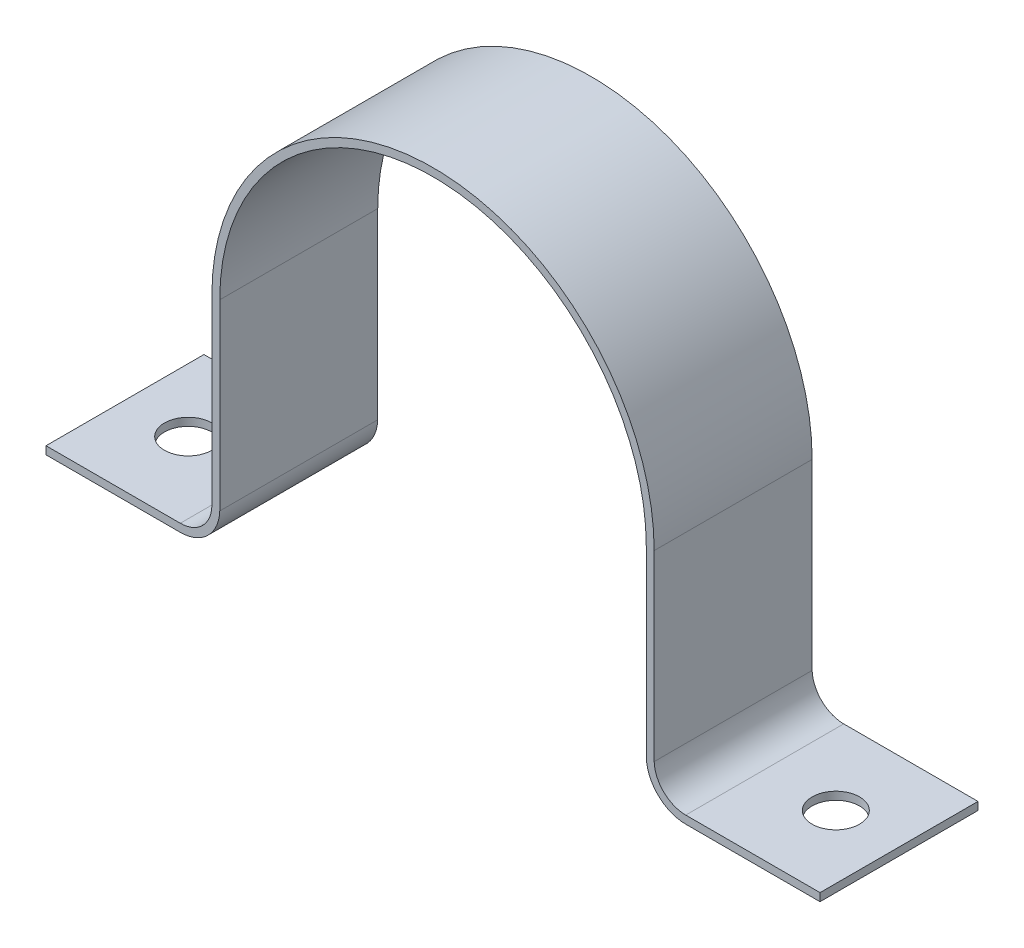
ISO-10303-21;
HEADER;
FILE_DESCRIPTION(('STEP AP214'),'2;1');
FILE_NAME('part.step','',(''),(''),'','','');
FILE_SCHEMA(('AUTOMOTIVE_DESIGN { 1 0 10303 214 1 1 1 1 }'));
ENDSEC;
DATA;
#1=APPLICATION_CONTEXT('core data for automotive mechanical design processes');
#2=APPLICATION_PROTOCOL_DEFINITION('international standard','automotive_design',2000,#1);
#3=PRODUCT_CONTEXT('',#1,'mechanical');
#4=PRODUCT('Part','Part','',(#3));
#5=PRODUCT_RELATED_PRODUCT_CATEGORY('part','',(#4));
#6=PRODUCT_DEFINITION_FORMATION('','',#4);
#7=PRODUCT_DEFINITION_CONTEXT('part definition',#1,'design');
#8=PRODUCT_DEFINITION('design','',#6,#7);
#9=PRODUCT_DEFINITION_SHAPE('','',#8);
#10=(LENGTH_UNIT() NAMED_UNIT(*) SI_UNIT(.MILLI.,.METRE.));
#11=(NAMED_UNIT(*) PLANE_ANGLE_UNIT() SI_UNIT($,.RADIAN.));
#12=(NAMED_UNIT(*) SI_UNIT($,.STERADIAN.) SOLID_ANGLE_UNIT());
#13=UNCERTAINTY_MEASURE_WITH_UNIT(LENGTH_MEASURE(1.E-05),#10,'distance_accuracy_value','');
#14=(GEOMETRIC_REPRESENTATION_CONTEXT(3) GLOBAL_UNCERTAINTY_ASSIGNED_CONTEXT((#13)) GLOBAL_UNIT_ASSIGNED_CONTEXT((#10,
#11,#12)) REPRESENTATION_CONTEXT('',''));
#15=CARTESIAN_POINT('',(0.,0.,0.));
#16=DIRECTION('',(0.,0.,1.));
#17=DIRECTION('',(1.,0.,0.));
#18=AXIS2_PLACEMENT_3D('',#15,#16,#17);
#19=CARTESIAN_POINT('',(20.5,-23.5,5.));
#20=DIRECTION('',(0.,1.,0.));
#21=DIRECTION('',(-1.,0.,0.));
#22=AXIS2_PLACEMENT_3D('',#19,#20,#21);
#23=CYLINDRICAL_SURFACE('',#22,1.5);
#24=CARTESIAN_POINT('',(20.5,-14.,5.));
#25=DIRECTION('',(0.,1.,0.));
#26=DIRECTION('',(-1.,0.,0.));
#27=AXIS2_PLACEMENT_3D('',#24,#25,#26);
#28=CIRCLE('',#27,1.5);
#29=CARTESIAN_POINT('',(19.,-14.,5.));
#30=VERTEX_POINT('',#29);
#31=EDGE_CURVE('E20',#30,#30,#28,.F.);
#32=ORIENTED_EDGE('',*,*,#31,.T.);
#33=EDGE_LOOP('',(#32));
#34=FACE_BOUND('',#33,.T.);
#35=CARTESIAN_POINT('',(20.5,-13.5,5.));
#36=DIRECTION('',(0.,1.,0.));
#37=DIRECTION('',(-1.,0.,0.));
#38=AXIS2_PLACEMENT_3D('',#35,#36,#37);
#39=CIRCLE('',#38,1.5);
#40=CARTESIAN_POINT('',(19.,-13.5,5.));
#41=VERTEX_POINT('',#40);
#42=EDGE_CURVE('E153',#41,#41,#39,.T.);
#43=ORIENTED_EDGE('',*,*,#42,.T.);
#44=EDGE_LOOP('',(#43));
#45=FACE_BOUND('',#44,.T.);
#46=ADVANCED_FACE('F17',(#34,#45),#23,.F.);
#47=CARTESIAN_POINT('',(24.5,-14.,10.));
#48=DIRECTION('',(-1.,0.,0.));
#49=DIRECTION('',(0.,0.,1.));
#50=AXIS2_PLACEMENT_3D('',#47,#48,#49);
#51=PLANE('',#50);
#52=DIRECTION('',(0.,0.,1.));
#53=VECTOR('',#52,1.);
#54=CARTESIAN_POINT('',(24.5,-13.5,10.));
#55=LINE('',#54,#53);
#56=CARTESIAN_POINT('',(24.5,-13.5,0.));
#57=VERTEX_POINT('',#56);
#58=CARTESIAN_POINT('',(24.5,-13.5,10.));
#59=VERTEX_POINT('',#58);
#60=EDGE_CURVE('E141',#57,#59,#55,.T.);
#61=ORIENTED_EDGE('',*,*,#60,.T.);
#62=DIRECTION('',(0.,1.,0.));
#63=VECTOR('',#62,1.);
#64=CARTESIAN_POINT('',(24.5,-14.,10.));
#65=LINE('',#64,#63);
#66=CARTESIAN_POINT('',(24.5,-14.,10.));
#67=VERTEX_POINT('',#66);
#68=EDGE_CURVE('E135',#67,#59,#65,.T.);
#69=ORIENTED_EDGE('',*,*,#68,.F.);
#70=DIRECTION('',(0.,0.,1.));
#71=VECTOR('',#70,1.);
#72=CARTESIAN_POINT('',(24.5,-14.,10.));
#73=LINE('',#72,#71);
#74=CARTESIAN_POINT('',(24.5,-14.,0.));
#75=VERTEX_POINT('',#74);
#76=EDGE_CURVE('E138',#67,#75,#73,.F.);
#77=ORIENTED_EDGE('',*,*,#76,.T.);
#78=DIRECTION('',(0.,1.,0.));
#79=VECTOR('',#78,1.);
#80=CARTESIAN_POINT('',(24.5,-14.,0.));
#81=LINE('',#80,#79);
#82=EDGE_CURVE('E125',#57,#75,#81,.F.);
#83=ORIENTED_EDGE('',*,*,#82,.F.);
#84=EDGE_LOOP('',(#61,#69,#77,#83));
#85=FACE_BOUND('',#84,.T.);
#86=ADVANCED_FACE('F137',(#85),#51,.F.);
#87=CARTESIAN_POINT('',(-20.5,-23.5,5.));
#88=DIRECTION('',(0.,1.,0.));
#89=DIRECTION('',(-1.,0.,0.));
#90=AXIS2_PLACEMENT_3D('',#87,#88,#89);
#91=CYLINDRICAL_SURFACE('',#90,1.5);
#92=CARTESIAN_POINT('',(-20.5,-14.,5.));
#93=DIRECTION('',(0.,1.,0.));
#94=DIRECTION('',(-1.,0.,0.));
#95=AXIS2_PLACEMENT_3D('',#92,#93,#94);
#96=CIRCLE('',#95,1.5);
#97=CARTESIAN_POINT('',(-22.,-14.,5.));
#98=VERTEX_POINT('',#97);
#99=EDGE_CURVE('E223',#98,#98,#96,.F.);
#100=ORIENTED_EDGE('',*,*,#99,.T.);
#101=EDGE_LOOP('',(#100));
#102=FACE_BOUND('',#101,.T.);
#103=CARTESIAN_POINT('',(-20.5,-13.5,5.));
#104=DIRECTION('',(0.,1.,0.));
#105=DIRECTION('',(-1.,0.,0.));
#106=AXIS2_PLACEMENT_3D('',#103,#104,#105);
#107=CIRCLE('',#106,1.5);
#108=CARTESIAN_POINT('',(-22.,-13.5,5.));
#109=VERTEX_POINT('',#108);
#110=EDGE_CURVE('E229',#109,#109,#107,.T.);
#111=ORIENTED_EDGE('',*,*,#110,.T.);
#112=EDGE_LOOP('',(#111));
#113=FACE_BOUND('',#112,.T.);
#114=ADVANCED_FACE('F350',(#102,#113),#91,.F.);
#115=CARTESIAN_POINT('',(-24.5,-14.,10.));
#116=DIRECTION('',(1.,0.,0.));
#117=DIRECTION('',(0.,0.,-1.));
#118=AXIS2_PLACEMENT_3D('',#115,#116,#117);
#119=PLANE('',#118);
#120=DIRECTION('',(0.,0.,1.));
#121=VECTOR('',#120,1.);
#122=CARTESIAN_POINT('',(-24.5,-14.,10.));
#123=LINE('',#122,#121);
#124=CARTESIAN_POINT('',(-24.5,-14.,0.));
#125=VERTEX_POINT('',#124);
#126=CARTESIAN_POINT('',(-24.5,-14.,10.));
#127=VERTEX_POINT('',#126);
#128=EDGE_CURVE('E220',#125,#127,#123,.T.);
#129=ORIENTED_EDGE('',*,*,#128,.T.);
#130=DIRECTION('',(0.,1.,0.));
#131=VECTOR('',#130,1.);
#132=CARTESIAN_POINT('',(-24.5,-14.,10.));
#133=LINE('',#132,#131);
#134=CARTESIAN_POINT('',(-24.5,-13.5,10.));
#135=VERTEX_POINT('',#134);
#136=EDGE_CURVE('E249',#135,#127,#133,.F.);
#137=ORIENTED_EDGE('',*,*,#136,.F.);
#138=DIRECTION('',(0.,0.,1.));
#139=VECTOR('',#138,1.);
#140=CARTESIAN_POINT('',(-24.5,-13.5,10.));
#141=LINE('',#140,#139);
#142=CARTESIAN_POINT('',(-24.5,-13.5,0.));
#143=VERTEX_POINT('',#142);
#144=EDGE_CURVE('E228',#135,#143,#141,.F.);
#145=ORIENTED_EDGE('',*,*,#144,.T.);
#146=DIRECTION('',(0.,1.,0.));
#147=VECTOR('',#146,1.);
#148=CARTESIAN_POINT('',(-24.5,-14.,0.));
#149=LINE('',#148,#147);
#150=EDGE_CURVE('E246',#125,#143,#149,.T.);
#151=ORIENTED_EDGE('',*,*,#150,.F.);
#152=EDGE_LOOP('',(#129,#137,#145,#151));
#153=FACE_BOUND('',#152,.T.);
#154=ADVANCED_FACE('F352',(#153),#119,.F.);
#155=CARTESIAN_POINT('',(0.,0.,10.));
#156=DIRECTION('',(0.,0.,-1.));
#157=DIRECTION('',(-1.,0.,0.));
#158=AXIS2_PLACEMENT_3D('',#155,#156,#157);
#159=CYLINDRICAL_SURFACE('',#158,13.5);
#160=DIRECTION('',(0.,0.,1.));
#161=VECTOR('',#160,1.);
#162=CARTESIAN_POINT('',(13.5,0.,10.));
#163=LINE('',#162,#161);
#164=CARTESIAN_POINT('',(13.5,0.,0.));
#165=VERTEX_POINT('',#164);
#166=CARTESIAN_POINT('',(13.5,0.,10.));
#167=VERTEX_POINT('',#166);
#168=EDGE_CURVE('E244',#165,#167,#163,.T.);
#169=ORIENTED_EDGE('',*,*,#168,.T.);
#170=CARTESIAN_POINT('',(0.,0.,10.));
#171=DIRECTION('',(0.,0.,-1.));
#172=DIRECTION('',(-1.,0.,0.));
#173=AXIS2_PLACEMENT_3D('',#170,#171,#172);
#174=CIRCLE('',#173,13.5);
#175=CARTESIAN_POINT('',(-13.5,0.,10.));
#176=VERTEX_POINT('',#175);
#177=EDGE_CURVE('E173',#176,#167,#174,.T.);
#178=ORIENTED_EDGE('',*,*,#177,.F.);
#179=DIRECTION('',(0.,0.,1.));
#180=VECTOR('',#179,1.);
#181=CARTESIAN_POINT('',(-13.5,0.,10.));
#182=LINE('',#181,#180);
#183=CARTESIAN_POINT('',(-13.5,0.,0.));
#184=VERTEX_POINT('',#183);
#185=EDGE_CURVE('E215',#176,#184,#182,.F.);
#186=ORIENTED_EDGE('',*,*,#185,.T.);
#187=CARTESIAN_POINT('',(0.,0.,0.));
#188=DIRECTION('',(0.,0.,-1.));
#189=DIRECTION('',(-1.,0.,0.));
#190=AXIS2_PLACEMENT_3D('',#187,#188,#189);
#191=CIRCLE('',#190,13.5);
#192=EDGE_CURVE('E187',#184,#165,#191,.T.);
#193=ORIENTED_EDGE('',*,*,#192,.T.);
#194=EDGE_LOOP('',(#169,#178,#186,#193));
#195=FACE_BOUND('',#194,.T.);
#196=ADVANCED_FACE('F359',(#195),#159,.F.);
#197=CARTESIAN_POINT('',(13.5,0.,10.));
#198=DIRECTION('',(1.,0.,0.));
#199=DIRECTION('',(0.,1.,0.));
#200=AXIS2_PLACEMENT_3D('',#197,#198,#199);
#201=PLANE('',#200);
#202=DIRECTION('',(0.,0.,-1.));
#203=VECTOR('',#202,1.);
#204=CARTESIAN_POINT('',(13.5,-11.5763224049815,10.));
#205=LINE('',#204,#203);
#206=CARTESIAN_POINT('',(13.5,-11.5763224049815,10.));
#207=VERTEX_POINT('',#206);
#208=CARTESIAN_POINT('',(13.5,-11.5763224049815,0.));
#209=VERTEX_POINT('',#208);
#210=EDGE_CURVE('E242',#207,#209,#205,.T.);
#211=ORIENTED_EDGE('',*,*,#210,.F.);
#212=DIRECTION('',(0.,1.,0.));
#213=VECTOR('',#212,1.);
#214=CARTESIAN_POINT('',(13.5,0.,10.));
#215=LINE('',#214,#213);
#216=EDGE_CURVE('E165',#167,#207,#215,.F.);
#217=ORIENTED_EDGE('',*,*,#216,.F.);
#218=ORIENTED_EDGE('',*,*,#168,.F.);
#219=DIRECTION('',(0.,1.,0.));
#220=VECTOR('',#219,1.);
#221=CARTESIAN_POINT('',(13.5,0.,0.));
#222=LINE('',#221,#220);
#223=EDGE_CURVE('E111',#165,#209,#222,.F.);
#224=ORIENTED_EDGE('',*,*,#223,.T.);
#225=EDGE_LOOP('',(#211,#217,#218,#224));
#226=FACE_BOUND('',#225,.T.);
#227=ADVANCED_FACE('F365',(#226),#201,.F.);
#228=CARTESIAN_POINT('',(15.9988347065178,-11.5,10.));
#229=DIRECTION('',(0.,0.,-1.));
#230=DIRECTION('',(-1.,0.,0.));
#231=AXIS2_PLACEMENT_3D('',#228,#229,#230);
#232=CYLINDRICAL_SURFACE('',#231,2.5);
#233=CARTESIAN_POINT('',(15.9988347065178,-11.5,10.));
#234=DIRECTION('',(0.,0.,-1.));
#235=DIRECTION('',(-1.,0.,0.));
#236=AXIS2_PLACEMENT_3D('',#233,#234,#235);
#237=CIRCLE('',#236,2.5);
#238=CARTESIAN_POINT('',(15.9988347065178,-14.,10.));
#239=VERTEX_POINT('',#238);
#240=EDGE_CURVE('E160',#207,#239,#237,.F.);
#241=ORIENTED_EDGE('',*,*,#240,.F.);
#242=ORIENTED_EDGE('',*,*,#210,.T.);
#243=CARTESIAN_POINT('',(15.9988347065178,-11.5,0.));
#244=DIRECTION('',(0.,0.,-1.));
#245=DIRECTION('',(-1.,0.,0.));
#246=AXIS2_PLACEMENT_3D('',#243,#244,#245);
#247=CIRCLE('',#246,2.5);
#248=CARTESIAN_POINT('',(15.9988347065178,-14.,0.));
#249=VERTEX_POINT('',#248);
#250=EDGE_CURVE('E117',#209,#249,#247,.F.);
#251=ORIENTED_EDGE('',*,*,#250,.T.);
#252=DIRECTION('',(0.,0.,1.));
#253=VECTOR('',#252,1.);
#254=CARTESIAN_POINT('',(15.9988347065178,-14.,10.));
#255=LINE('',#254,#253);
#256=EDGE_CURVE('E154',#249,#239,#255,.T.);
#257=ORIENTED_EDGE('',*,*,#256,.T.);
#258=EDGE_LOOP('',(#241,#242,#251,#257));
#259=FACE_BOUND('',#258,.T.);
#260=ADVANCED_FACE('F302',(#259),#232,.T.);
#261=CARTESIAN_POINT('',(15.9988347065178,-14.,10.));
#262=DIRECTION('',(0.,1.,0.));
#263=DIRECTION('',(0.,0.,1.));
#264=AXIS2_PLACEMENT_3D('',#261,#262,#263);
#265=PLANE('',#264);
#266=ORIENTED_EDGE('',*,*,#76,.F.);
#267=DIRECTION('',(1.,0.,0.));
#268=VECTOR('',#267,1.);
#269=CARTESIAN_POINT('',(0.,-14.,10.));
#270=LINE('',#269,#268);
#271=EDGE_CURVE('E150',#239,#67,#270,.T.);
#272=ORIENTED_EDGE('',*,*,#271,.F.);
#273=ORIENTED_EDGE('',*,*,#256,.F.);
#274=DIRECTION('',(1.,0.,0.));
#275=VECTOR('',#274,1.);
#276=CARTESIAN_POINT('',(0.,-14.,0.));
#277=LINE('',#276,#275);
#278=EDGE_CURVE('E152',#249,#75,#277,.T.);
#279=ORIENTED_EDGE('',*,*,#278,.T.);
#280=EDGE_LOOP('',(#266,#272,#273,#279));
#281=FACE_BOUND('',#280,.T.);
#282=ORIENTED_EDGE('',*,*,#31,.F.);
#283=EDGE_LOOP('',(#282));
#284=FACE_BOUND('',#283,.T.);
#285=ADVANCED_FACE('F148',(#281,#284),#265,.F.);
#286=CARTESIAN_POINT('',(24.5,-13.5,10.));
#287=DIRECTION('',(0.,-1.,0.));
#288=DIRECTION('',(1.,0.,0.));
#289=AXIS2_PLACEMENT_3D('',#286,#287,#288);
#290=PLANE('',#289);
#291=DIRECTION('',(0.,0.,-1.));
#292=VECTOR('',#291,1.);
#293=CARTESIAN_POINT('',(15.9988347065178,-13.5,10.));
#294=LINE('',#293,#292);
#295=CARTESIAN_POINT('',(15.9988347065178,-13.5,0.));
#296=VERTEX_POINT('',#295);
#297=CARTESIAN_POINT('',(15.9988347065178,-13.5,10.));
#298=VERTEX_POINT('',#297);
#299=EDGE_CURVE('E208',#296,#298,#294,.F.);
#300=ORIENTED_EDGE('',*,*,#299,.T.);
#301=DIRECTION('',(1.,0.,0.));
#302=VECTOR('',#301,1.);
#303=CARTESIAN_POINT('',(0.,-13.5,10.));
#304=LINE('',#303,#302);
#305=EDGE_CURVE('E161',#59,#298,#304,.F.);
#306=ORIENTED_EDGE('',*,*,#305,.F.);
#307=ORIENTED_EDGE('',*,*,#60,.F.);
#308=DIRECTION('',(1.,0.,0.));
#309=VECTOR('',#308,1.);
#310=CARTESIAN_POINT('',(0.,-13.5,0.));
#311=LINE('',#310,#309);
#312=EDGE_CURVE('E199',#57,#296,#311,.F.);
#313=ORIENTED_EDGE('',*,*,#312,.T.);
#314=EDGE_LOOP('',(#300,#306,#307,#313));
#315=FACE_BOUND('',#314,.T.);
#316=ORIENTED_EDGE('',*,*,#42,.F.);
#317=EDGE_LOOP('',(#316));
#318=FACE_BOUND('',#317,.T.);
#319=ADVANCED_FACE('F289',(#315,#318),#290,.F.);
#320=CARTESIAN_POINT('',(-15.9988347065178,-11.5,10.));
#321=DIRECTION('',(0.,0.,-1.));
#322=DIRECTION('',(-1.,0.,0.));
#323=AXIS2_PLACEMENT_3D('',#320,#321,#322);
#324=CYLINDRICAL_SURFACE('',#323,2.);
#325=DIRECTION('',(0.,0.,1.));
#326=VECTOR('',#325,1.);
#327=CARTESIAN_POINT('',(-15.9988347065178,-13.5,10.));
#328=LINE('',#327,#326);
#329=CARTESIAN_POINT('',(-15.9988347065178,-13.5,0.));
#330=VERTEX_POINT('',#329);
#331=CARTESIAN_POINT('',(-15.9988347065178,-13.5,10.));
#332=VERTEX_POINT('',#331);
#333=EDGE_CURVE('E226',#330,#332,#328,.T.);
#334=ORIENTED_EDGE('',*,*,#333,.T.);
#335=CARTESIAN_POINT('',(-15.9988347065178,-11.5,10.));
#336=DIRECTION('',(0.,0.,-1.));
#337=DIRECTION('',(-1.,0.,0.));
#338=AXIS2_PLACEMENT_3D('',#335,#336,#337);
#339=CIRCLE('',#338,2.);
#340=CARTESIAN_POINT('',(-14.,-11.5682628450913,10.));
#341=VERTEX_POINT('',#340);
#342=EDGE_CURVE('E268',#341,#332,#339,.T.);
#343=ORIENTED_EDGE('',*,*,#342,.F.);
#344=DIRECTION('',(0.,0.,-1.));
#345=VECTOR('',#344,1.);
#346=CARTESIAN_POINT('',(-14.,-11.5682628450913,10.));
#347=LINE('',#346,#345);
#348=CARTESIAN_POINT('',(-14.,-11.5682628450913,0.));
#349=VERTEX_POINT('',#348);
#350=EDGE_CURVE('E183',#341,#349,#347,.T.);
#351=ORIENTED_EDGE('',*,*,#350,.T.);
#352=CARTESIAN_POINT('',(-15.9988347065178,-11.5,0.));
#353=DIRECTION('',(0.,0.,-1.));
#354=DIRECTION('',(-1.,0.,0.));
#355=AXIS2_PLACEMENT_3D('',#352,#353,#354);
#356=CIRCLE('',#355,2.);
#357=EDGE_CURVE('E196',#349,#330,#356,.T.);
#358=ORIENTED_EDGE('',*,*,#357,.T.);
#359=EDGE_LOOP('',(#334,#343,#351,#358));
#360=FACE_BOUND('',#359,.T.);
#361=ADVANCED_FACE('F291',(#360),#324,.F.);
#362=CARTESIAN_POINT('',(-24.5,-13.5,10.));
#363=DIRECTION('',(0.,-1.,0.));
#364=DIRECTION('',(1.,0.,0.));
#365=AXIS2_PLACEMENT_3D('',#362,#363,#364);
#366=PLANE('',#365);
#367=ORIENTED_EDGE('',*,*,#144,.F.);
#368=DIRECTION('',(1.,0.,0.));
#369=VECTOR('',#368,1.);
#370=CARTESIAN_POINT('',(0.,-13.5,10.));
#371=LINE('',#370,#369);
#372=EDGE_CURVE('E271',#332,#135,#371,.F.);
#373=ORIENTED_EDGE('',*,*,#372,.F.);
#374=ORIENTED_EDGE('',*,*,#333,.F.);
#375=DIRECTION('',(1.,0.,0.));
#376=VECTOR('',#375,1.);
#377=CARTESIAN_POINT('',(0.,-13.5,0.));
#378=LINE('',#377,#376);
#379=EDGE_CURVE('E191',#330,#143,#378,.F.);
#380=ORIENTED_EDGE('',*,*,#379,.T.);
#381=EDGE_LOOP('',(#367,#373,#374,#380));
#382=FACE_BOUND('',#381,.T.);
#383=ORIENTED_EDGE('',*,*,#110,.F.);
#384=EDGE_LOOP('',(#383));
#385=FACE_BOUND('',#384,.T.);
#386=ADVANCED_FACE('F299',(#382,#385),#366,.F.);
#387=CARTESIAN_POINT('',(-15.9988347065178,-14.,10.));
#388=DIRECTION('',(0.,1.,0.));
#389=DIRECTION('',(-1.,0.,0.));
#390=AXIS2_PLACEMENT_3D('',#387,#388,#389);
#391=PLANE('',#390);
#392=DIRECTION('',(0.,0.,-1.));
#393=VECTOR('',#392,1.);
#394=CARTESIAN_POINT('',(-15.9988347065178,-14.,10.));
#395=LINE('',#394,#393);
#396=CARTESIAN_POINT('',(-15.9988347065178,-14.,10.));
#397=VERTEX_POINT('',#396);
#398=CARTESIAN_POINT('',(-15.9988347065178,-14.,0.));
#399=VERTEX_POINT('',#398);
#400=EDGE_CURVE('E216',#397,#399,#395,.T.);
#401=ORIENTED_EDGE('',*,*,#400,.F.);
#402=DIRECTION('',(1.,0.,0.));
#403=VECTOR('',#402,1.);
#404=CARTESIAN_POINT('',(0.,-14.,10.));
#405=LINE('',#404,#403);
#406=EDGE_CURVE('E267',#127,#397,#405,.T.);
#407=ORIENTED_EDGE('',*,*,#406,.F.);
#408=ORIENTED_EDGE('',*,*,#128,.F.);
#409=DIRECTION('',(1.,0.,0.));
#410=VECTOR('',#409,1.);
#411=CARTESIAN_POINT('',(0.,-14.,0.));
#412=LINE('',#411,#410);
#413=EDGE_CURVE('E189',#125,#399,#412,.T.);
#414=ORIENTED_EDGE('',*,*,#413,.T.);
#415=EDGE_LOOP('',(#401,#407,#408,#414));
#416=FACE_BOUND('',#415,.T.);
#417=ORIENTED_EDGE('',*,*,#99,.F.);
#418=EDGE_LOOP('',(#417));
#419=FACE_BOUND('',#418,.T.);
#420=ADVANCED_FACE('F335',(#416,#419),#391,.F.);
#421=CARTESIAN_POINT('',(-15.9988347065178,-11.5,10.));
#422=DIRECTION('',(0.,0.,-1.));
#423=DIRECTION('',(-1.,0.,0.));
#424=AXIS2_PLACEMENT_3D('',#421,#422,#423);
#425=CYLINDRICAL_SURFACE('',#424,2.5);
#426=CARTESIAN_POINT('',(-15.9988347065178,-11.5,10.));
#427=DIRECTION('',(0.,0.,-1.));
#428=DIRECTION('',(-1.,0.,0.));
#429=AXIS2_PLACEMENT_3D('',#426,#427,#428);
#430=CIRCLE('',#429,2.5);
#431=CARTESIAN_POINT('',(-13.5,-11.5763224049815,10.));
#432=VERTEX_POINT('',#431);
#433=EDGE_CURVE('E265',#397,#432,#430,.F.);
#434=ORIENTED_EDGE('',*,*,#433,.F.);
#435=ORIENTED_EDGE('',*,*,#400,.T.);
#436=CARTESIAN_POINT('',(-15.9988347065178,-11.5,0.));
#437=DIRECTION('',(0.,0.,-1.));
#438=DIRECTION('',(-1.,0.,0.));
#439=AXIS2_PLACEMENT_3D('',#436,#437,#438);
#440=CIRCLE('',#439,2.5);
#441=CARTESIAN_POINT('',(-13.5,-11.5763224049815,0.));
#442=VERTEX_POINT('',#441);
#443=EDGE_CURVE('E188',#399,#442,#440,.F.);
#444=ORIENTED_EDGE('',*,*,#443,.T.);
#445=DIRECTION('',(0.,0.,1.));
#446=VECTOR('',#445,1.);
#447=CARTESIAN_POINT('',(-13.5,-11.5763224049815,10.));
#448=LINE('',#447,#446);
#449=EDGE_CURVE('E213',#442,#432,#448,.T.);
#450=ORIENTED_EDGE('',*,*,#449,.T.);
#451=EDGE_LOOP('',(#434,#435,#444,#450));
#452=FACE_BOUND('',#451,.T.);
#453=ADVANCED_FACE('F331',(#452),#425,.T.);
#454=CARTESIAN_POINT('',(-13.5,0.,10.));
#455=DIRECTION('',(-1.,0.,0.));
#456=DIRECTION('',(0.,-1.,0.));
#457=AXIS2_PLACEMENT_3D('',#454,#455,#456);
#458=PLANE('',#457);
#459=ORIENTED_EDGE('',*,*,#185,.F.);
#460=DIRECTION('',(0.,1.,0.));
#461=VECTOR('',#460,1.);
#462=CARTESIAN_POINT('',(-13.5,0.,10.));
#463=LINE('',#462,#461);
#464=EDGE_CURVE('E212',#432,#176,#463,.T.);
#465=ORIENTED_EDGE('',*,*,#464,.F.);
#466=ORIENTED_EDGE('',*,*,#449,.F.);
#467=DIRECTION('',(0.,1.,0.));
#468=VECTOR('',#467,1.);
#469=CARTESIAN_POINT('',(-13.5,0.,0.));
#470=LINE('',#469,#468);
#471=EDGE_CURVE('E184',#442,#184,#470,.T.);
#472=ORIENTED_EDGE('',*,*,#471,.T.);
#473=EDGE_LOOP('',(#459,#465,#466,#472));
#474=FACE_BOUND('',#473,.T.);
#475=ADVANCED_FACE('F327',(#474),#458,.F.);
#476=CARTESIAN_POINT('',(15.9988347065178,-11.5,10.));
#477=DIRECTION('',(0.,0.,-1.));
#478=DIRECTION('',(-1.,0.,0.));
#479=AXIS2_PLACEMENT_3D('',#476,#477,#478);
#480=CYLINDRICAL_SURFACE('',#479,2.);
#481=DIRECTION('',(0.,0.,1.));
#482=VECTOR('',#481,1.);
#483=CARTESIAN_POINT('',(14.,-11.5682628450913,10.));
#484=LINE('',#483,#482);
#485=CARTESIAN_POINT('',(14.,-11.5682628450914,0.));
#486=VERTEX_POINT('',#485);
#487=CARTESIAN_POINT('',(14.,-11.5682628450914,10.));
#488=VERTEX_POINT('',#487);
#489=EDGE_CURVE('E180',#486,#488,#484,.T.);
#490=ORIENTED_EDGE('',*,*,#489,.T.);
#491=CARTESIAN_POINT('',(15.9988347065178,-11.5,10.));
#492=DIRECTION('',(0.,0.,-1.));
#493=DIRECTION('',(-1.,0.,0.));
#494=AXIS2_PLACEMENT_3D('',#491,#492,#493);
#495=CIRCLE('',#494,2.);
#496=EDGE_CURVE('E163',#298,#488,#495,.T.);
#497=ORIENTED_EDGE('',*,*,#496,.F.);
#498=ORIENTED_EDGE('',*,*,#299,.F.);
#499=CARTESIAN_POINT('',(15.9988347065178,-11.5,0.));
#500=DIRECTION('',(0.,0.,-1.));
#501=DIRECTION('',(-1.,0.,0.));
#502=AXIS2_PLACEMENT_3D('',#499,#500,#501);
#503=CIRCLE('',#502,2.);
#504=EDGE_CURVE('E201',#296,#486,#503,.T.);
#505=ORIENTED_EDGE('',*,*,#504,.T.);
#506=EDGE_LOOP('',(#490,#497,#498,#505));
#507=FACE_BOUND('',#506,.T.);
#508=ADVANCED_FACE('F324',(#507),#480,.F.);
#509=CARTESIAN_POINT('',(0.,0.,0.));
#510=DIRECTION('',(0.,0.,1.));
#511=DIRECTION('',(1.,0.,0.));
#512=AXIS2_PLACEMENT_3D('',#509,#510,#511);
#513=PLANE('',#512);
#514=ORIENTED_EDGE('',*,*,#471,.F.);
#515=ORIENTED_EDGE('',*,*,#443,.F.);
#516=ORIENTED_EDGE('',*,*,#413,.F.);
#517=ORIENTED_EDGE('',*,*,#150,.T.);
#518=ORIENTED_EDGE('',*,*,#379,.F.);
#519=ORIENTED_EDGE('',*,*,#357,.F.);
#520=DIRECTION('',(0.,1.,0.));
#521=VECTOR('',#520,1.);
#522=CARTESIAN_POINT('',(-14.,-11.5682628450913,0.));
#523=LINE('',#522,#521);
#524=CARTESIAN_POINT('',(-14.,0.,0.));
#525=VERTEX_POINT('',#524);
#526=EDGE_CURVE('E181',#349,#525,#523,.T.);
#527=ORIENTED_EDGE('',*,*,#526,.T.);
#528=CARTESIAN_POINT('',(0.,0.,0.));
#529=DIRECTION('',(0.,0.,-1.));
#530=DIRECTION('',(-1.,0.,0.));
#531=AXIS2_PLACEMENT_3D('',#528,#529,#530);
#532=CIRCLE('',#531,14.);
#533=CARTESIAN_POINT('',(14.,0.,0.));
#534=VERTEX_POINT('',#533);
#535=EDGE_CURVE('E176',#534,#525,#532,.F.);
#536=ORIENTED_EDGE('',*,*,#535,.F.);
#537=DIRECTION('',(0.,-1.,0.));
#538=VECTOR('',#537,1.);
#539=CARTESIAN_POINT('',(14.,-11.5682628450913,0.));
#540=LINE('',#539,#538);
#541=EDGE_CURVE('E179',#534,#486,#540,.T.);
#542=ORIENTED_EDGE('',*,*,#541,.T.);
#543=ORIENTED_EDGE('',*,*,#504,.F.);
#544=ORIENTED_EDGE('',*,*,#312,.F.);
#545=ORIENTED_EDGE('',*,*,#82,.T.);
#546=ORIENTED_EDGE('',*,*,#278,.F.);
#547=ORIENTED_EDGE('',*,*,#250,.F.);
#548=ORIENTED_EDGE('',*,*,#223,.F.);
#549=ORIENTED_EDGE('',*,*,#192,.F.);
#550=EDGE_LOOP('',(#514,#515,#516,#517,#518,#519,#527,#536,#542,#543,#544,#545,#546,#547,#548,#549));
#551=FACE_BOUND('',#550,.T.);
#552=ADVANCED_FACE('F320',(#551),#513,.F.);
#553=CARTESIAN_POINT('',(-14.,-11.5682628450913,10.));
#554=DIRECTION('',(1.,0.,0.));
#555=DIRECTION('',(0.,0.,-1.));
#556=AXIS2_PLACEMENT_3D('',#553,#554,#555);
#557=PLANE('',#556);
#558=ORIENTED_EDGE('',*,*,#350,.F.);
#559=DIRECTION('',(0.,1.,0.));
#560=VECTOR('',#559,1.);
#561=CARTESIAN_POINT('',(-14.,0.,10.));
#562=LINE('',#561,#560);
#563=CARTESIAN_POINT('',(-14.,0.,10.));
#564=VERTEX_POINT('',#563);
#565=EDGE_CURVE('E272',#564,#341,#562,.F.);
#566=ORIENTED_EDGE('',*,*,#565,.F.);
#567=DIRECTION('',(0.,0.,-1.));
#568=VECTOR('',#567,1.);
#569=CARTESIAN_POINT('',(-14.,0.,10.));
#570=LINE('',#569,#568);
#571=EDGE_CURVE('E174',#525,#564,#570,.F.);
#572=ORIENTED_EDGE('',*,*,#571,.F.);
#573=ORIENTED_EDGE('',*,*,#526,.F.);
#574=EDGE_LOOP('',(#558,#566,#572,#573));
#575=FACE_BOUND('',#574,.T.);
#576=ADVANCED_FACE('F317',(#575),#557,.F.);
#577=CARTESIAN_POINT('',(0.,0.,10.));
#578=DIRECTION('',(0.,0.,1.));
#579=DIRECTION('',(1.,0.,0.));
#580=AXIS2_PLACEMENT_3D('',#577,#578,#579);
#581=PLANE('',#580);
#582=ORIENTED_EDGE('',*,*,#433,.T.);
#583=ORIENTED_EDGE('',*,*,#464,.T.);
#584=ORIENTED_EDGE('',*,*,#177,.T.);
#585=ORIENTED_EDGE('',*,*,#216,.T.);
#586=ORIENTED_EDGE('',*,*,#240,.T.);
#587=ORIENTED_EDGE('',*,*,#271,.T.);
#588=ORIENTED_EDGE('',*,*,#68,.T.);
#589=ORIENTED_EDGE('',*,*,#305,.T.);
#590=ORIENTED_EDGE('',*,*,#496,.T.);
#591=DIRECTION('',(0.,-1.,0.));
#592=VECTOR('',#591,1.);
#593=CARTESIAN_POINT('',(14.,-11.5682628450913,10.));
#594=LINE('',#593,#592);
#595=CARTESIAN_POINT('',(14.,0.,10.));
#596=VERTEX_POINT('',#595);
#597=EDGE_CURVE('E35',#488,#596,#594,.F.);
#598=ORIENTED_EDGE('',*,*,#597,.T.);
#599=CARTESIAN_POINT('',(0.,0.,10.));
#600=DIRECTION('',(0.,0.,-1.));
#601=DIRECTION('',(-1.,0.,0.));
#602=AXIS2_PLACEMENT_3D('',#599,#600,#601);
#603=CIRCLE('',#602,14.);
#604=EDGE_CURVE('E26',#564,#596,#603,.T.);
#605=ORIENTED_EDGE('',*,*,#604,.F.);
#606=ORIENTED_EDGE('',*,*,#565,.T.);
#607=ORIENTED_EDGE('',*,*,#342,.T.);
#608=ORIENTED_EDGE('',*,*,#372,.T.);
#609=ORIENTED_EDGE('',*,*,#136,.T.);
#610=ORIENTED_EDGE('',*,*,#406,.T.);
#611=EDGE_LOOP('',(#582,#583,#584,#585,#586,#587,#588,#589,#590,#598,#605,#606,#607,#608,#609,#610));
#612=FACE_BOUND('',#611,.T.);
#613=ADVANCED_FACE('F157',(#612),#581,.T.);
#614=CARTESIAN_POINT('',(14.,-11.5682628450913,10.));
#615=DIRECTION('',(-1.,0.,0.));
#616=DIRECTION('',(0.,-1.,0.));
#617=AXIS2_PLACEMENT_3D('',#614,#615,#616);
#618=PLANE('',#617);
#619=DIRECTION('',(0.,0.,-1.));
#620=VECTOR('',#619,1.);
#621=CARTESIAN_POINT('',(14.,0.,10.));
#622=LINE('',#621,#620);
#623=EDGE_CURVE('E11',#596,#534,#622,.T.);
#624=ORIENTED_EDGE('',*,*,#623,.F.);
#625=ORIENTED_EDGE('',*,*,#597,.F.);
#626=ORIENTED_EDGE('',*,*,#489,.F.);
#627=ORIENTED_EDGE('',*,*,#541,.F.);
#628=EDGE_LOOP('',(#624,#625,#626,#627));
#629=FACE_BOUND('',#628,.T.);
#630=ADVANCED_FACE('F306',(#629),#618,.F.);
#631=CARTESIAN_POINT('',(0.,0.,10.));
#632=DIRECTION('',(0.,0.,-1.));
#633=DIRECTION('',(-1.,0.,0.));
#634=AXIS2_PLACEMENT_3D('',#631,#632,#633);
#635=CYLINDRICAL_SURFACE('',#634,14.);
#636=ORIENTED_EDGE('',*,*,#604,.T.);
#637=ORIENTED_EDGE('',*,*,#623,.T.);
#638=ORIENTED_EDGE('',*,*,#535,.T.);
#639=ORIENTED_EDGE('',*,*,#571,.T.);
#640=EDGE_LOOP('',(#636,#637,#638,#639));
#641=FACE_BOUND('',#640,.T.);
#642=ADVANCED_FACE('F304',(#641),#635,.T.);
#643=CLOSED_SHELL('',(#46,#86,#114,#154,#196,#227,#260,#285,#319,#361,#386,#420,#453,#475,#508,
#552,#576,#613,#630,#642));
#644=MANIFOLD_SOLID_BREP('B1',#643);
#645=ADVANCED_BREP_SHAPE_REPRESENTATION('',(#18,#644),#14);
#646=SHAPE_DEFINITION_REPRESENTATION(#9,#645);
ENDSEC;
END-ISO-10303-21;
